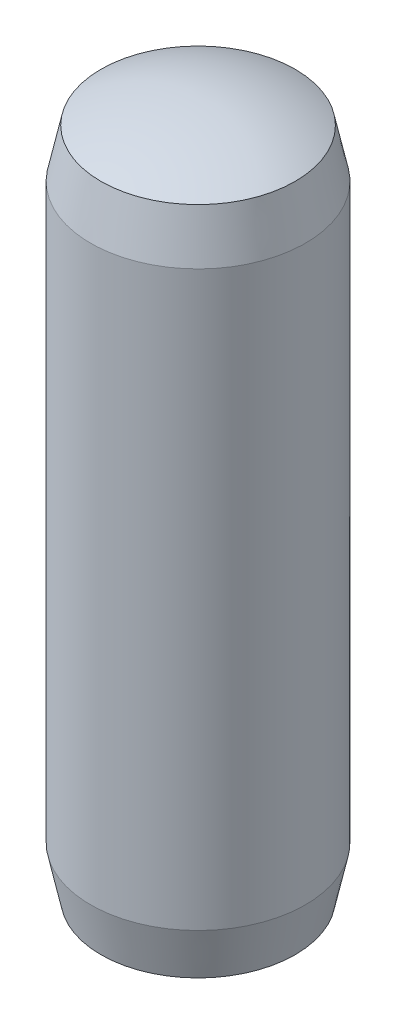
ISO-10303-21;
HEADER;
FILE_DESCRIPTION(('STEP AP214'),'2;1');
FILE_NAME('part.step','',(''),(''),'','','');
FILE_SCHEMA(('AUTOMOTIVE_DESIGN { 1 0 10303 214 1 1 1 1 }'));
ENDSEC;
DATA;
#1=APPLICATION_CONTEXT('core data for automotive mechanical design processes');
#2=APPLICATION_PROTOCOL_DEFINITION('international standard','automotive_design',2000,#1);
#3=PRODUCT_CONTEXT('',#1,'mechanical');
#4=PRODUCT('Part','Part','',(#3));
#5=PRODUCT_RELATED_PRODUCT_CATEGORY('part','',(#4));
#6=PRODUCT_DEFINITION_FORMATION('','',#4);
#7=PRODUCT_DEFINITION_CONTEXT('part definition',#1,'design');
#8=PRODUCT_DEFINITION('design','',#6,#7);
#9=PRODUCT_DEFINITION_SHAPE('','',#8);
#10=(LENGTH_UNIT() NAMED_UNIT(*) SI_UNIT(.MILLI.,.METRE.));
#11=(NAMED_UNIT(*) PLANE_ANGLE_UNIT() SI_UNIT($,.RADIAN.));
#12=(NAMED_UNIT(*) SI_UNIT($,.STERADIAN.) SOLID_ANGLE_UNIT());
#13=UNCERTAINTY_MEASURE_WITH_UNIT(LENGTH_MEASURE(1.E-05),#10,'distance_accuracy_value','');
#14=(GEOMETRIC_REPRESENTATION_CONTEXT(3) GLOBAL_UNCERTAINTY_ASSIGNED_CONTEXT((#13)) GLOBAL_UNIT_ASSIGNED_CONTEXT((#10,
#11,#12)) REPRESENTATION_CONTEXT('',''));
#15=CARTESIAN_POINT('',(0.,0.,0.));
#16=DIRECTION('',(0.,0.,1.));
#17=DIRECTION('',(1.,0.,0.));
#18=AXIS2_PLACEMENT_3D('',#15,#16,#17);
#19=CARTESIAN_POINT('',(0.,5.,0.));
#20=DIRECTION('',(0.,-1.,0.));
#21=DIRECTION('',(0.,0.,-1.));
#22=AXIS2_PLACEMENT_3D('',#19,#20,#21);
#23=CYLINDRICAL_SURFACE('',#22,0.75);
#24=CARTESIAN_POINT('',(0.,4.5,0.));
#25=DIRECTION('',(0.,-1.,0.));
#26=DIRECTION('',(0.,0.,-1.));
#27=AXIS2_PLACEMENT_3D('',#24,#25,#26);
#28=CIRCLE('',#27,0.75);
#29=CARTESIAN_POINT('',(0.,4.5,-0.75));
#30=VERTEX_POINT('',#29);
#31=EDGE_CURVE('E13',#30,#30,#28,.T.);
#32=ORIENTED_EDGE('',*,*,#31,.T.);
#33=EDGE_LOOP('',(#32));
#34=FACE_BOUND('',#33,.T.);
#35=CARTESIAN_POINT('',(0.,0.5,0.));
#36=DIRECTION('',(0.,-1.,0.));
#37=DIRECTION('',(0.,0.,-1.));
#38=AXIS2_PLACEMENT_3D('',#35,#36,#37);
#39=CIRCLE('',#38,0.75);
#40=CARTESIAN_POINT('',(0.,0.5,-0.75));
#41=VERTEX_POINT('',#40);
#42=EDGE_CURVE('E68',#41,#41,#39,.T.);
#43=ORIENTED_EDGE('',*,*,#42,.F.);
#44=EDGE_LOOP('',(#43));
#45=FACE_BOUND('',#44,.T.);
#46=ADVANCED_FACE('F46',(#34,#45),#23,.T.);
#47=CARTESIAN_POINT('',(0.,4.5,0.));
#48=DIRECTION('',(0.,-1.,0.));
#49=DIRECTION('',(0.,0.,-1.));
#50=AXIS2_PLACEMENT_3D('',#47,#48,#49);
#51=CONICAL_SURFACE('',#50,0.75,0.209439510239312);
#52=CARTESIAN_POINT('',(0.,4.83794161592573,0.));
#53=DIRECTION('',(0.,-1.,0.));
#54=DIRECTION('',(0.,0.,-1.));
#55=AXIS2_PLACEMENT_3D('',#52,#53,#54);
#56=CIRCLE('',#55,0.678168292073619);
#57=CARTESIAN_POINT('',(0.,4.83794161592573,-0.678168292073619));
#58=VERTEX_POINT('',#57);
#59=EDGE_CURVE('E53',#58,#58,#56,.T.);
#60=ORIENTED_EDGE('',*,*,#59,.T.);
#61=EDGE_LOOP('',(#60));
#62=FACE_BOUND('',#61,.T.);
#63=ORIENTED_EDGE('',*,*,#31,.F.);
#64=EDGE_LOOP('',(#63));
#65=FACE_BOUND('',#64,.T.);
#66=ADVANCED_FACE('F63',(#62,#65),#51,.T.);
#67=CARTESIAN_POINT('',(0.,3.5,0.));
#68=DIRECTION('',(0.,-1.,0.));
#69=DIRECTION('',(1.,0.,0.));
#70=AXIS2_PLACEMENT_3D('',#67,#68,#69);
#71=SPHERICAL_SURFACE('',#70,1.5);
#72=CARTESIAN_POINT('',(0.,5.,0.));
#73=VERTEX_POINT('',#72);
#74=VERTEX_LOOP('',#73);
#75=FACE_BOUND('',#74,.T.);
#76=ORIENTED_EDGE('',*,*,#59,.F.);
#77=EDGE_LOOP('',(#76));
#78=FACE_BOUND('',#77,.T.);
#79=ADVANCED_FACE('F59',(#75,#78),#71,.T.);
#80=CARTESIAN_POINT('',(0.,0.162058384074271,0.));
#81=DIRECTION('',(0.,1.,0.));
#82=DIRECTION('',(0.,0.,1.));
#83=AXIS2_PLACEMENT_3D('',#80,#81,#82);
#84=CONICAL_SURFACE('',#83,0.678168292073618,0.209439510239312);
#85=ORIENTED_EDGE('',*,*,#42,.T.);
#86=EDGE_LOOP('',(#85));
#87=FACE_BOUND('',#86,.T.);
#88=CARTESIAN_POINT('',(0.,0.162058384074271,0.));
#89=DIRECTION('',(0.,-1.,0.));
#90=DIRECTION('',(0.,0.,-1.));
#91=AXIS2_PLACEMENT_3D('',#88,#89,#90);
#92=CIRCLE('',#91,0.678168292073618);
#93=CARTESIAN_POINT('',(0.,0.162058384074271,-0.678168292073618));
#94=VERTEX_POINT('',#93);
#95=EDGE_CURVE('E70',#94,#94,#92,.T.);
#96=ORIENTED_EDGE('',*,*,#95,.F.);
#97=EDGE_LOOP('',(#96));
#98=FACE_BOUND('',#97,.T.);
#99=ADVANCED_FACE('F62',(#87,#98),#84,.T.);
#100=CARTESIAN_POINT('',(0.,1.5,0.));
#101=DIRECTION('',(0.,-1.,0.));
#102=DIRECTION('',(1.,0.,0.));
#103=AXIS2_PLACEMENT_3D('',#100,#101,#102);
#104=SPHERICAL_SURFACE('',#103,1.5);
#105=CARTESIAN_POINT('',(0.,0.,0.));
#106=VERTEX_POINT('',#105);
#107=VERTEX_LOOP('',#106);
#108=FACE_BOUND('',#107,.T.);
#109=ORIENTED_EDGE('',*,*,#95,.T.);
#110=EDGE_LOOP('',(#109));
#111=FACE_BOUND('',#110,.T.);
#112=ADVANCED_FACE('F76',(#108,#111),#104,.T.);
#113=CLOSED_SHELL('',(#46,#66,#79,#99,#112));
#114=MANIFOLD_SOLID_BREP('B2',#113);
#115=ADVANCED_BREP_SHAPE_REPRESENTATION('',(#18,#114),#14);
#116=SHAPE_DEFINITION_REPRESENTATION(#9,#115);
ENDSEC;
END-ISO-10303-21;
